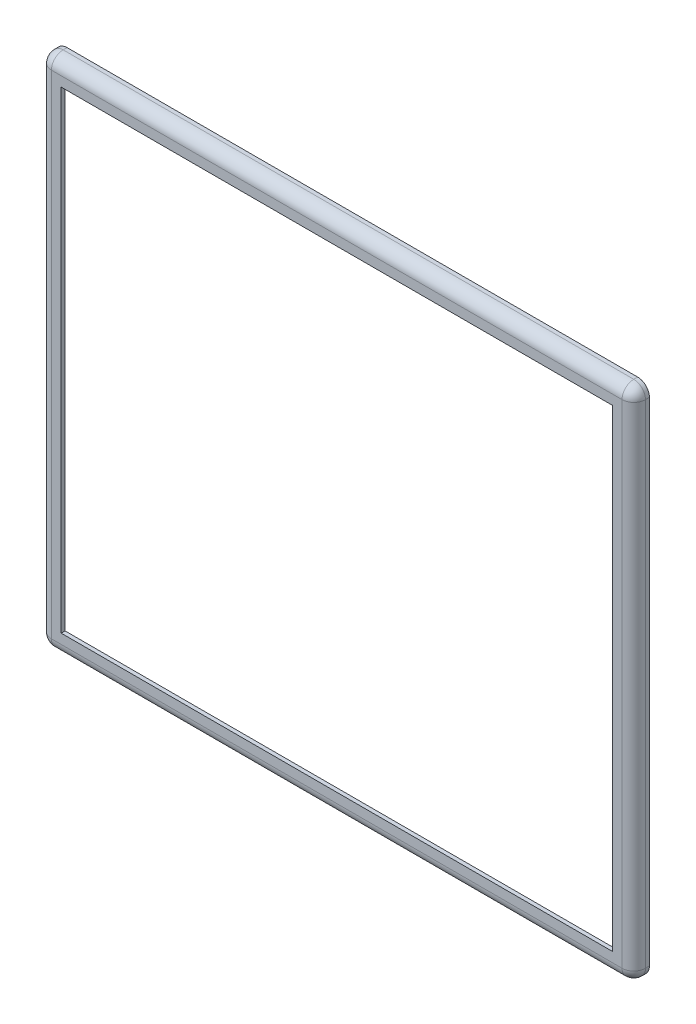
ISO-10303-21;
HEADER;
FILE_DESCRIPTION(('STEP AP214'),'2;1');
FILE_NAME('part.step','',(''),(''),'','','');
FILE_SCHEMA(('AUTOMOTIVE_DESIGN { 1 0 10303 214 1 1 1 1 }'));
ENDSEC;
DATA;
#1=APPLICATION_CONTEXT('core data for automotive mechanical design processes');
#2=APPLICATION_PROTOCOL_DEFINITION('international standard','automotive_design',2000,#1);
#3=PRODUCT_CONTEXT('',#1,'mechanical');
#4=PRODUCT('Part','Part','',(#3));
#5=PRODUCT_RELATED_PRODUCT_CATEGORY('part','',(#4));
#6=PRODUCT_DEFINITION_FORMATION('','',#4);
#7=PRODUCT_DEFINITION_CONTEXT('part definition',#1,'design');
#8=PRODUCT_DEFINITION('design','',#6,#7);
#9=PRODUCT_DEFINITION_SHAPE('','',#8);
#10=(LENGTH_UNIT() NAMED_UNIT(*) SI_UNIT(.MILLI.,.METRE.));
#11=(NAMED_UNIT(*) PLANE_ANGLE_UNIT() SI_UNIT($,.RADIAN.));
#12=(NAMED_UNIT(*) SI_UNIT($,.STERADIAN.) SOLID_ANGLE_UNIT());
#13=UNCERTAINTY_MEASURE_WITH_UNIT(LENGTH_MEASURE(1.E-05),#10,'distance_accuracy_value','');
#14=(GEOMETRIC_REPRESENTATION_CONTEXT(3) GLOBAL_UNCERTAINTY_ASSIGNED_CONTEXT((#13)) GLOBAL_UNIT_ASSIGNED_CONTEXT((#10,
#11,#12)) REPRESENTATION_CONTEXT('',''));
#15=CARTESIAN_POINT('',(0.,0.,0.));
#16=DIRECTION('',(0.,0.,1.));
#17=DIRECTION('',(1.,0.,0.));
#18=AXIS2_PLACEMENT_3D('',#15,#16,#17);
#19=CARTESIAN_POINT('',(0.,0.,0.));
#20=DIRECTION('',(0.,0.,1.));
#21=DIRECTION('',(1.,0.,0.));
#22=AXIS2_PLACEMENT_3D('',#19,#20,#21);
#23=PLANE('',#22);
#24=DIRECTION('',(0.,1.,0.));
#25=VECTOR('',#24,1.);
#26=CARTESIAN_POINT('',(75.6206322795341,58.0332778702163,0.));
#27=LINE('',#26,#25);
#28=CARTESIAN_POINT('',(75.6206322795341,-70.9667221297837,0.));
#29=VERTEX_POINT('',#28);
#30=CARTESIAN_POINT('',(75.6206322795341,55.0332778702163,0.));
#31=VERTEX_POINT('',#30);
#32=EDGE_CURVE('E260',#29,#31,#27,.T.);
#33=ORIENTED_EDGE('',*,*,#32,.F.);
#34=CARTESIAN_POINT('',(72.6206322795341,-70.9667221297837,0.));
#35=DIRECTION('',(0.,0.,1.));
#36=DIRECTION('',(1.,0.,0.));
#37=AXIS2_PLACEMENT_3D('',#34,#35,#36);
#38=CIRCLE('',#37,3.);
#39=CARTESIAN_POINT('',(72.6206322795341,-73.9667221297837,0.));
#40=VERTEX_POINT('',#39);
#41=EDGE_CURVE('E355',#29,#40,#38,.F.);
#42=ORIENTED_EDGE('',*,*,#41,.T.);
#43=DIRECTION('',(1.,0.,0.));
#44=VECTOR('',#43,1.);
#45=CARTESIAN_POINT('',(-76.3793677204659,-73.9667221297837,0.));
#46=LINE('',#45,#44);
#47=CARTESIAN_POINT('',(-73.3793677204659,-73.9667221297837,0.));
#48=VERTEX_POINT('',#47);
#49=EDGE_CURVE('E257',#48,#40,#46,.T.);
#50=ORIENTED_EDGE('',*,*,#49,.F.);
#51=CARTESIAN_POINT('',(-73.3793677204659,-70.9667221297837,0.));
#52=DIRECTION('',(0.,0.,1.));
#53=DIRECTION('',(1.,0.,0.));
#54=AXIS2_PLACEMENT_3D('',#51,#52,#53);
#55=CIRCLE('',#54,3.);
#56=CARTESIAN_POINT('',(-76.3793677204659,-70.9667221297837,0.));
#57=VERTEX_POINT('',#56);
#58=EDGE_CURVE('E349',#48,#57,#55,.F.);
#59=ORIENTED_EDGE('',*,*,#58,.T.);
#60=DIRECTION('',(0.,-1.,0.));
#61=VECTOR('',#60,1.);
#62=CARTESIAN_POINT('',(-76.3793677204659,58.0332778702163,0.));
#63=LINE('',#62,#61);
#64=CARTESIAN_POINT('',(-76.3793677204659,55.0332778702163,0.));
#65=VERTEX_POINT('',#64);
#66=EDGE_CURVE('E254',#65,#57,#63,.T.);
#67=ORIENTED_EDGE('',*,*,#66,.F.);
#68=CARTESIAN_POINT('',(-73.3793677204659,55.0332778702163,0.));
#69=DIRECTION('',(0.,0.,1.));
#70=DIRECTION('',(1.,0.,0.));
#71=AXIS2_PLACEMENT_3D('',#68,#69,#70);
#72=CIRCLE('',#71,3.);
#73=CARTESIAN_POINT('',(-73.3793677204659,58.0332778702163,0.));
#74=VERTEX_POINT('',#73);
#75=EDGE_CURVE('E351',#65,#74,#72,.F.);
#76=ORIENTED_EDGE('',*,*,#75,.T.);
#77=DIRECTION('',(-1.,0.,0.));
#78=VECTOR('',#77,1.);
#79=CARTESIAN_POINT('',(-76.3793677204659,58.0332778702163,0.));
#80=LINE('',#79,#78);
#81=CARTESIAN_POINT('',(72.6206322795341,58.0332778702163,0.));
#82=VERTEX_POINT('',#81);
#83=EDGE_CURVE('E263',#82,#74,#80,.T.);
#84=ORIENTED_EDGE('',*,*,#83,.F.);
#85=CARTESIAN_POINT('',(72.6206322795341,55.0332778702163,0.));
#86=DIRECTION('',(0.,0.,1.));
#87=DIRECTION('',(1.,0.,0.));
#88=AXIS2_PLACEMENT_3D('',#85,#86,#87);
#89=CIRCLE('',#88,3.);
#90=EDGE_CURVE('E353',#82,#31,#89,.F.);
#91=ORIENTED_EDGE('',*,*,#90,.T.);
#92=EDGE_LOOP('',(#33,#42,#50,#59,#67,#76,#84,#91));
#93=FACE_BOUND('',#92,.T.);
#94=DIRECTION('',(-1.,0.,0.));
#95=VECTOR('',#94,1.);
#96=CARTESIAN_POINT('',(-75.3793677204659,57.0332778702163,0.));
#97=LINE('',#96,#95);
#98=CARTESIAN_POINT('',(73.2206322795341,57.0332778702163,0.));
#99=VERTEX_POINT('',#98);
#100=CARTESIAN_POINT('',(-73.9793677204659,57.0332778702163,0.));
#101=VERTEX_POINT('',#100);
#102=EDGE_CURVE('E251',#99,#101,#97,.T.);
#103=ORIENTED_EDGE('',*,*,#102,.T.);
#104=CARTESIAN_POINT('',(-73.9793677204659,55.6332778702163,0.));
#105=DIRECTION('',(0.,0.,1.));
#106=DIRECTION('',(1.,0.,0.));
#107=AXIS2_PLACEMENT_3D('',#104,#105,#106);
#108=CIRCLE('',#107,1.4);
#109=CARTESIAN_POINT('',(-75.3793677204659,55.6332778702163,0.));
#110=VERTEX_POINT('',#109);
#111=EDGE_CURVE('E302',#101,#110,#108,.T.);
#112=ORIENTED_EDGE('',*,*,#111,.T.);
#113=DIRECTION('',(0.,-1.,0.));
#114=VECTOR('',#113,1.);
#115=CARTESIAN_POINT('',(-75.3793677204659,57.0332778702163,0.));
#116=LINE('',#115,#114);
#117=CARTESIAN_POINT('',(-75.3793677204659,-71.5667221297837,0.));
#118=VERTEX_POINT('',#117);
#119=EDGE_CURVE('E218',#110,#118,#116,.T.);
#120=ORIENTED_EDGE('',*,*,#119,.T.);
#121=CARTESIAN_POINT('',(-73.9793677204659,-71.5667221297837,0.));
#122=DIRECTION('',(0.,0.,1.));
#123=DIRECTION('',(1.,0.,0.));
#124=AXIS2_PLACEMENT_3D('',#121,#122,#123);
#125=CIRCLE('',#124,1.4);
#126=CARTESIAN_POINT('',(-73.9793677204659,-72.9667221297837,0.));
#127=VERTEX_POINT('',#126);
#128=EDGE_CURVE('E304',#118,#127,#125,.T.);
#129=ORIENTED_EDGE('',*,*,#128,.T.);
#130=DIRECTION('',(1.,0.,0.));
#131=VECTOR('',#130,1.);
#132=CARTESIAN_POINT('',(-75.3793677204659,-72.9667221297837,0.));
#133=LINE('',#132,#131);
#134=CARTESIAN_POINT('',(73.2206322795341,-72.9667221297837,0.));
#135=VERTEX_POINT('',#134);
#136=EDGE_CURVE('E245',#127,#135,#133,.T.);
#137=ORIENTED_EDGE('',*,*,#136,.T.);
#138=CARTESIAN_POINT('',(73.2206322795341,-71.5667221297837,0.));
#139=DIRECTION('',(0.,0.,1.));
#140=DIRECTION('',(1.,0.,0.));
#141=AXIS2_PLACEMENT_3D('',#138,#139,#140);
#142=CIRCLE('',#141,1.4);
#143=CARTESIAN_POINT('',(74.6206322795341,-71.5667221297837,0.));
#144=VERTEX_POINT('',#143);
#145=EDGE_CURVE('E306',#135,#144,#142,.T.);
#146=ORIENTED_EDGE('',*,*,#145,.T.);
#147=DIRECTION('',(0.,1.,0.));
#148=VECTOR('',#147,1.);
#149=CARTESIAN_POINT('',(74.6206322795341,57.0332778702163,0.));
#150=LINE('',#149,#148);
#151=CARTESIAN_POINT('',(74.6206322795341,55.6332778702163,0.));
#152=VERTEX_POINT('',#151);
#153=EDGE_CURVE('E248',#144,#152,#150,.T.);
#154=ORIENTED_EDGE('',*,*,#153,.T.);
#155=CARTESIAN_POINT('',(73.2206322795341,55.6332778702163,0.));
#156=DIRECTION('',(0.,0.,1.));
#157=DIRECTION('',(1.,0.,0.));
#158=AXIS2_PLACEMENT_3D('',#155,#156,#157);
#159=CIRCLE('',#158,1.4);
#160=EDGE_CURVE('E300',#152,#99,#159,.T.);
#161=ORIENTED_EDGE('',*,*,#160,.T.);
#162=EDGE_LOOP('',(#103,#112,#120,#129,#137,#146,#154,#161));
#163=FACE_BOUND('',#162,.T.);
#164=ADVANCED_FACE('F35',(#93,#163),#23,.F.);
#165=CARTESIAN_POINT('',(-76.3793677204659,58.0332778702163,3.));
#166=DIRECTION('',(1.,0.,0.));
#167=DIRECTION('',(0.,1.,0.));
#168=AXIS2_PLACEMENT_3D('',#165,#166,#167);
#169=PLANE('',#168);
#170=DIRECTION('',(0.,-1.,0.));
#171=VECTOR('',#170,1.);
#172=CARTESIAN_POINT('',(-76.3793677204659,58.0332778702163,1.));
#173=LINE('',#172,#171);
#174=CARTESIAN_POINT('',(-76.3793677204659,-70.9667221297837,1.));
#175=VERTEX_POINT('',#174);
#176=CARTESIAN_POINT('',(-76.3793677204659,55.0332778702163,1.));
#177=VERTEX_POINT('',#176);
#178=EDGE_CURVE('E369',#175,#177,#173,.F.);
#179=ORIENTED_EDGE('',*,*,#178,.T.);
#180=DIRECTION('',(0.,0.,-1.));
#181=VECTOR('',#180,1.);
#182=CARTESIAN_POINT('',(-76.3793677204659,55.0332778702163,3.));
#183=LINE('',#182,#181);
#184=EDGE_CURVE('E373',#177,#65,#183,.T.);
#185=ORIENTED_EDGE('',*,*,#184,.T.);
#186=ORIENTED_EDGE('',*,*,#66,.T.);
#187=DIRECTION('',(0.,0.,-1.));
#188=VECTOR('',#187,1.);
#189=CARTESIAN_POINT('',(-76.3793677204659,-70.9667221297837,3.));
#190=LINE('',#189,#188);
#191=EDGE_CURVE('E371',#57,#175,#190,.F.);
#192=ORIENTED_EDGE('',*,*,#191,.T.);
#193=EDGE_LOOP('',(#179,#185,#186,#192));
#194=FACE_BOUND('',#193,.T.);
#195=ADVANCED_FACE('F423',(#194),#169,.F.);
#196=CARTESIAN_POINT('',(-76.3793677204659,-73.9667221297837,3.));
#197=DIRECTION('',(0.,1.,0.));
#198=DIRECTION('',(0.,0.,1.));
#199=AXIS2_PLACEMENT_3D('',#196,#197,#198);
#200=PLANE('',#199);
#201=ORIENTED_EDGE('',*,*,#49,.T.);
#202=DIRECTION('',(0.,0.,-1.));
#203=VECTOR('',#202,1.);
#204=CARTESIAN_POINT('',(72.6206322795341,-73.9667221297837,3.));
#205=LINE('',#204,#203);
#206=CARTESIAN_POINT('',(72.6206322795341,-73.9667221297837,1.));
#207=VERTEX_POINT('',#206);
#208=EDGE_CURVE('E361',#40,#207,#205,.F.);
#209=ORIENTED_EDGE('',*,*,#208,.T.);
#210=DIRECTION('',(1.,0.,0.));
#211=VECTOR('',#210,1.);
#212=CARTESIAN_POINT('',(-76.3793677204659,-73.9667221297837,1.));
#213=LINE('',#212,#211);
#214=CARTESIAN_POINT('',(-73.3793677204659,-73.9667221297837,1.));
#215=VERTEX_POINT('',#214);
#216=EDGE_CURVE('E357',#207,#215,#213,.F.);
#217=ORIENTED_EDGE('',*,*,#216,.T.);
#218=DIRECTION('',(0.,0.,-1.));
#219=VECTOR('',#218,1.);
#220=CARTESIAN_POINT('',(-73.3793677204659,-73.9667221297837,3.));
#221=LINE('',#220,#219);
#222=EDGE_CURVE('E359',#215,#48,#221,.T.);
#223=ORIENTED_EDGE('',*,*,#222,.T.);
#224=EDGE_LOOP('',(#201,#209,#217,#223));
#225=FACE_BOUND('',#224,.T.);
#226=ADVANCED_FACE('F479',(#225),#200,.F.);
#227=CARTESIAN_POINT('',(75.6206322795341,58.0332778702163,3.));
#228=DIRECTION('',(-1.,0.,0.));
#229=DIRECTION('',(0.,-1.,0.));
#230=AXIS2_PLACEMENT_3D('',#227,#228,#229);
#231=PLANE('',#230);
#232=DIRECTION('',(0.,1.,0.));
#233=VECTOR('',#232,1.);
#234=CARTESIAN_POINT('',(75.6206322795341,-73.9667221297837,1.));
#235=LINE('',#234,#233);
#236=CARTESIAN_POINT('',(75.6206322795341,55.0332778702163,1.));
#237=VERTEX_POINT('',#236);
#238=CARTESIAN_POINT('',(75.6206322795341,-70.9667221297837,1.));
#239=VERTEX_POINT('',#238);
#240=EDGE_CURVE('E308',#237,#239,#235,.F.);
#241=ORIENTED_EDGE('',*,*,#240,.T.);
#242=DIRECTION('',(0.,0.,-1.));
#243=VECTOR('',#242,1.);
#244=CARTESIAN_POINT('',(75.6206322795341,-70.9667221297837,3.));
#245=LINE('',#244,#243);
#246=EDGE_CURVE('E346',#239,#29,#245,.T.);
#247=ORIENTED_EDGE('',*,*,#246,.T.);
#248=ORIENTED_EDGE('',*,*,#32,.T.);
#249=DIRECTION('',(0.,0.,-1.));
#250=VECTOR('',#249,1.);
#251=CARTESIAN_POINT('',(75.6206322795341,55.0332778702163,3.));
#252=LINE('',#251,#250);
#253=EDGE_CURVE('E344',#31,#237,#252,.F.);
#254=ORIENTED_EDGE('',*,*,#253,.T.);
#255=EDGE_LOOP('',(#241,#247,#248,#254));
#256=FACE_BOUND('',#255,.T.);
#257=ADVANCED_FACE('F455',(#256),#231,.F.);
#258=CARTESIAN_POINT('',(-76.3793677204659,58.0332778702163,3.));
#259=DIRECTION('',(0.,-1.,0.));
#260=DIRECTION('',(0.,0.,-1.));
#261=AXIS2_PLACEMENT_3D('',#258,#259,#260);
#262=PLANE('',#261);
#263=DIRECTION('',(-1.,0.,0.));
#264=VECTOR('',#263,1.);
#265=CARTESIAN_POINT('',(75.6206322795341,58.0332778702163,1.));
#266=LINE('',#265,#264);
#267=CARTESIAN_POINT('',(-73.3793677204659,58.0332778702163,1.));
#268=VERTEX_POINT('',#267);
#269=CARTESIAN_POINT('',(72.6206322795341,58.0332778702163,1.));
#270=VERTEX_POINT('',#269);
#271=EDGE_CURVE('E363',#268,#270,#266,.F.);
#272=ORIENTED_EDGE('',*,*,#271,.T.);
#273=DIRECTION('',(0.,0.,-1.));
#274=VECTOR('',#273,1.);
#275=CARTESIAN_POINT('',(72.6206322795341,58.0332778702163,3.));
#276=LINE('',#275,#274);
#277=EDGE_CURVE('E367',#270,#82,#276,.T.);
#278=ORIENTED_EDGE('',*,*,#277,.T.);
#279=ORIENTED_EDGE('',*,*,#83,.T.);
#280=DIRECTION('',(0.,0.,-1.));
#281=VECTOR('',#280,1.);
#282=CARTESIAN_POINT('',(-73.3793677204659,58.0332778702163,3.));
#283=LINE('',#282,#281);
#284=EDGE_CURVE('E365',#74,#268,#283,.F.);
#285=ORIENTED_EDGE('',*,*,#284,.T.);
#286=EDGE_LOOP('',(#272,#278,#279,#285));
#287=FACE_BOUND('',#286,.T.);
#288=ADVANCED_FACE('F468',(#287),#262,.F.);
#289=CARTESIAN_POINT('',(-75.3793677204659,57.0332778702163,3.));
#290=DIRECTION('',(1.,0.,0.));
#291=DIRECTION('',(0.,1.,0.));
#292=AXIS2_PLACEMENT_3D('',#289,#290,#291);
#293=PLANE('',#292);
#294=ORIENTED_EDGE('',*,*,#119,.F.);
#295=DIRECTION('',(0.,0.,-1.));
#296=VECTOR('',#295,1.);
#297=CARTESIAN_POINT('',(-75.3793677204659,55.6332778702163,3.));
#298=LINE('',#297,#296);
#299=CARTESIAN_POINT('',(-75.3793677204659,55.6332778702163,1.6));
#300=VERTEX_POINT('',#299);
#301=EDGE_CURVE('E283',#110,#300,#298,.F.);
#302=ORIENTED_EDGE('',*,*,#301,.T.);
#303=DIRECTION('',(0.,-1.,0.));
#304=VECTOR('',#303,1.);
#305=CARTESIAN_POINT('',(-75.3793677204659,57.0332778702163,1.6));
#306=LINE('',#305,#304);
#307=CARTESIAN_POINT('',(-75.3793677204659,-71.5667221297837,1.6));
#308=VERTEX_POINT('',#307);
#309=EDGE_CURVE('E279',#300,#308,#306,.T.);
#310=ORIENTED_EDGE('',*,*,#309,.T.);
#311=DIRECTION('',(0.,0.,-1.));
#312=VECTOR('',#311,1.);
#313=CARTESIAN_POINT('',(-75.3793677204659,-71.5667221297837,0.));
#314=LINE('',#313,#312);
#315=EDGE_CURVE('E281',#308,#118,#314,.T.);
#316=ORIENTED_EDGE('',*,*,#315,.T.);
#317=EDGE_LOOP('',(#294,#302,#310,#316));
#318=FACE_BOUND('',#317,.T.);
#319=ADVANCED_FACE('F470',(#318),#293,.T.);
#320=CARTESIAN_POINT('',(-75.3793677204659,-72.9667221297837,3.));
#321=DIRECTION('',(0.,1.,0.));
#322=DIRECTION('',(0.,0.,1.));
#323=AXIS2_PLACEMENT_3D('',#320,#321,#322);
#324=PLANE('',#323);
#325=ORIENTED_EDGE('',*,*,#136,.F.);
#326=DIRECTION('',(0.,0.,-1.));
#327=VECTOR('',#326,1.);
#328=CARTESIAN_POINT('',(-73.9793677204659,-72.9667221297837,3.));
#329=LINE('',#328,#327);
#330=CARTESIAN_POINT('',(-73.9793677204659,-72.9667221297837,1.6));
#331=VERTEX_POINT('',#330);
#332=EDGE_CURVE('E289',#127,#331,#329,.F.);
#333=ORIENTED_EDGE('',*,*,#332,.T.);
#334=DIRECTION('',(1.,0.,0.));
#335=VECTOR('',#334,1.);
#336=CARTESIAN_POINT('',(-75.3793677204659,-72.9667221297837,1.6));
#337=LINE('',#336,#335);
#338=CARTESIAN_POINT('',(73.2206322795341,-72.9667221297837,1.6));
#339=VERTEX_POINT('',#338);
#340=EDGE_CURVE('E285',#331,#339,#337,.T.);
#341=ORIENTED_EDGE('',*,*,#340,.T.);
#342=DIRECTION('',(0.,0.,-1.));
#343=VECTOR('',#342,1.);
#344=CARTESIAN_POINT('',(73.2206322795341,-72.9667221297837,0.));
#345=LINE('',#344,#343);
#346=EDGE_CURVE('E287',#339,#135,#345,.T.);
#347=ORIENTED_EDGE('',*,*,#346,.T.);
#348=EDGE_LOOP('',(#325,#333,#341,#347));
#349=FACE_BOUND('',#348,.T.);
#350=ADVANCED_FACE('F476',(#349),#324,.T.);
#351=CARTESIAN_POINT('',(74.6206322795341,57.0332778702163,3.));
#352=DIRECTION('',(-1.,0.,0.));
#353=DIRECTION('',(0.,0.,1.));
#354=AXIS2_PLACEMENT_3D('',#351,#352,#353);
#355=PLANE('',#354);
#356=DIRECTION('',(0.,1.,0.));
#357=VECTOR('',#356,1.);
#358=CARTESIAN_POINT('',(74.6206322795341,57.0332778702163,1.6));
#359=LINE('',#358,#357);
#360=CARTESIAN_POINT('',(74.6206322795341,-71.5667221297837,1.6));
#361=VERTEX_POINT('',#360);
#362=CARTESIAN_POINT('',(74.6206322795341,55.6332778702163,1.6));
#363=VERTEX_POINT('',#362);
#364=EDGE_CURVE('E266',#361,#363,#359,.T.);
#365=ORIENTED_EDGE('',*,*,#364,.T.);
#366=DIRECTION('',(0.,0.,-1.));
#367=VECTOR('',#366,1.);
#368=CARTESIAN_POINT('',(74.6206322795341,55.6332778702163,0.));
#369=LINE('',#368,#367);
#370=EDGE_CURVE('E270',#363,#152,#369,.T.);
#371=ORIENTED_EDGE('',*,*,#370,.T.);
#372=ORIENTED_EDGE('',*,*,#153,.F.);
#373=DIRECTION('',(0.,0.,-1.));
#374=VECTOR('',#373,1.);
#375=CARTESIAN_POINT('',(74.6206322795341,-71.5667221297837,3.));
#376=LINE('',#375,#374);
#377=EDGE_CURVE('E268',#144,#361,#376,.F.);
#378=ORIENTED_EDGE('',*,*,#377,.T.);
#379=EDGE_LOOP('',(#365,#371,#372,#378));
#380=FACE_BOUND('',#379,.T.);
#381=ADVANCED_FACE('F490',(#380),#355,.T.);
#382=CARTESIAN_POINT('',(-75.3793677204659,57.0332778702163,3.));
#383=DIRECTION('',(0.,-1.,0.));
#384=DIRECTION('',(0.,0.,-1.));
#385=AXIS2_PLACEMENT_3D('',#382,#383,#384);
#386=PLANE('',#385);
#387=ORIENTED_EDGE('',*,*,#102,.F.);
#388=DIRECTION('',(0.,0.,-1.));
#389=VECTOR('',#388,1.);
#390=CARTESIAN_POINT('',(73.2206322795341,57.0332778702163,3.));
#391=LINE('',#390,#389);
#392=CARTESIAN_POINT('',(73.2206322795341,57.0332778702163,1.6));
#393=VERTEX_POINT('',#392);
#394=EDGE_CURVE('E277',#99,#393,#391,.F.);
#395=ORIENTED_EDGE('',*,*,#394,.T.);
#396=DIRECTION('',(-1.,0.,0.));
#397=VECTOR('',#396,1.);
#398=CARTESIAN_POINT('',(-75.3793677204659,57.0332778702163,1.6));
#399=LINE('',#398,#397);
#400=CARTESIAN_POINT('',(-73.9793677204659,57.0332778702163,1.6));
#401=VERTEX_POINT('',#400);
#402=EDGE_CURVE('E273',#393,#401,#399,.T.);
#403=ORIENTED_EDGE('',*,*,#402,.T.);
#404=DIRECTION('',(0.,0.,-1.));
#405=VECTOR('',#404,1.);
#406=CARTESIAN_POINT('',(-73.9793677204659,57.0332778702163,0.));
#407=LINE('',#406,#405);
#408=EDGE_CURVE('E275',#401,#101,#407,.T.);
#409=ORIENTED_EDGE('',*,*,#408,.T.);
#410=EDGE_LOOP('',(#387,#395,#403,#409));
#411=FACE_BOUND('',#410,.T.);
#412=ADVANCED_FACE('F494',(#411),#386,.T.);
#413=CARTESIAN_POINT('',(0.,0.,4.));
#414=DIRECTION('',(0.,0.,1.));
#415=DIRECTION('',(1.,0.,0.));
#416=AXIS2_PLACEMENT_3D('',#413,#414,#415);
#417=PLANE('',#416);
#418=DIRECTION('',(1.,0.,0.));
#419=VECTOR('',#418,1.);
#420=CARTESIAN_POINT('',(75.6206322795341,-70.9667221297837,4.));
#421=LINE('',#420,#419);
#422=CARTESIAN_POINT('',(-73.3793677204659,-70.9667221297837,4.));
#423=VERTEX_POINT('',#422);
#424=CARTESIAN_POINT('',(72.6206322795341,-70.9667221297837,4.));
#425=VERTEX_POINT('',#424);
#426=EDGE_CURVE('E375',#423,#425,#421,.T.);
#427=ORIENTED_EDGE('',*,*,#426,.T.);
#428=DIRECTION('',(0.,1.,0.));
#429=VECTOR('',#428,1.);
#430=CARTESIAN_POINT('',(72.6206322795341,58.0332778702163,4.));
#431=LINE('',#430,#429);
#432=CARTESIAN_POINT('',(72.6206322795341,55.0332778702163,4.));
#433=VERTEX_POINT('',#432);
#434=EDGE_CURVE('E11',#425,#433,#431,.T.);
#435=ORIENTED_EDGE('',*,*,#434,.T.);
#436=DIRECTION('',(-1.,0.,0.));
#437=VECTOR('',#436,1.);
#438=CARTESIAN_POINT('',(-76.3793677204659,55.0332778702163,4.));
#439=LINE('',#438,#437);
#440=CARTESIAN_POINT('',(-73.3793677204659,55.0332778702163,4.));
#441=VERTEX_POINT('',#440);
#442=EDGE_CURVE('E44',#433,#441,#439,.T.);
#443=ORIENTED_EDGE('',*,*,#442,.T.);
#444=DIRECTION('',(0.,-1.,0.));
#445=VECTOR('',#444,1.);
#446=CARTESIAN_POINT('',(-73.3793677204659,-73.9667221297837,4.));
#447=LINE('',#446,#445);
#448=EDGE_CURVE('E377',#441,#423,#447,.T.);
#449=ORIENTED_EDGE('',*,*,#448,.T.);
#450=EDGE_LOOP('',(#427,#435,#443,#449));
#451=FACE_BOUND('',#450,.T.);
#452=DIRECTION('',(1.,0.,0.));
#453=VECTOR('',#452,1.);
#454=CARTESIAN_POINT('',(-70.8793677204659,-68.4667221297837,4.));
#455=LINE('',#454,#453);
#456=CARTESIAN_POINT('',(-70.8793677204659,-68.4667221297837,4.));
#457=VERTEX_POINT('',#456);
#458=CARTESIAN_POINT('',(70.1206322795341,-68.4667221297837,4.));
#459=VERTEX_POINT('',#458);
#460=EDGE_CURVE('E210',#457,#459,#455,.T.);
#461=ORIENTED_EDGE('',*,*,#460,.F.);
#462=DIRECTION('',(0.,-1.,0.));
#463=VECTOR('',#462,1.);
#464=CARTESIAN_POINT('',(-70.8793677204659,52.5332778702163,4.));
#465=LINE('',#464,#463);
#466=CARTESIAN_POINT('',(-70.8793677204659,52.5332778702163,4.));
#467=VERTEX_POINT('',#466);
#468=EDGE_CURVE('E200',#467,#457,#465,.T.);
#469=ORIENTED_EDGE('',*,*,#468,.F.);
#470=DIRECTION('',(-1.,0.,0.));
#471=VECTOR('',#470,1.);
#472=CARTESIAN_POINT('',(-70.8793677204659,52.5332778702163,4.));
#473=LINE('',#472,#471);
#474=CARTESIAN_POINT('',(70.1206322795341,52.5332778702163,4.));
#475=VERTEX_POINT('',#474);
#476=EDGE_CURVE('E226',#475,#467,#473,.T.);
#477=ORIENTED_EDGE('',*,*,#476,.F.);
#478=DIRECTION('',(0.,1.,0.));
#479=VECTOR('',#478,1.);
#480=CARTESIAN_POINT('',(70.1206322795341,52.5332778702163,4.));
#481=LINE('',#480,#479);
#482=EDGE_CURVE('E224',#459,#475,#481,.T.);
#483=ORIENTED_EDGE('',*,*,#482,.F.);
#484=EDGE_LOOP('',(#461,#469,#477,#483));
#485=FACE_BOUND('',#484,.T.);
#486=ADVANCED_FACE('F222',(#451,#485),#417,.T.);
#487=CARTESIAN_POINT('',(0.,0.,3.));
#488=DIRECTION('',(0.,0.,1.));
#489=DIRECTION('',(1.,0.,0.));
#490=AXIS2_PLACEMENT_3D('',#487,#488,#489);
#491=PLANE('',#490);
#492=DIRECTION('',(-1.,0.,0.));
#493=VECTOR('',#492,1.);
#494=CARTESIAN_POINT('',(0.,55.6332778702163,3.));
#495=LINE('',#494,#493);
#496=CARTESIAN_POINT('',(-73.9793677204659,55.6332778702163,3.));
#497=VERTEX_POINT('',#496);
#498=CARTESIAN_POINT('',(73.2206322795341,55.6332778702163,3.));
#499=VERTEX_POINT('',#498);
#500=EDGE_CURVE('E295',#497,#499,#495,.F.);
#501=ORIENTED_EDGE('',*,*,#500,.T.);
#502=DIRECTION('',(0.,1.,0.));
#503=VECTOR('',#502,1.);
#504=CARTESIAN_POINT('',(73.2206322795341,0.,3.));
#505=LINE('',#504,#503);
#506=CARTESIAN_POINT('',(73.2206322795341,-71.5667221297837,3.));
#507=VERTEX_POINT('',#506);
#508=EDGE_CURVE('E297',#499,#507,#505,.F.);
#509=ORIENTED_EDGE('',*,*,#508,.T.);
#510=DIRECTION('',(1.,0.,0.));
#511=VECTOR('',#510,1.);
#512=CARTESIAN_POINT('',(0.,-71.5667221297837,3.));
#513=LINE('',#512,#511);
#514=CARTESIAN_POINT('',(-73.9793677204659,-71.5667221297837,3.));
#515=VERTEX_POINT('',#514);
#516=EDGE_CURVE('E291',#507,#515,#513,.F.);
#517=ORIENTED_EDGE('',*,*,#516,.T.);
#518=DIRECTION('',(0.,-1.,0.));
#519=VECTOR('',#518,1.);
#520=CARTESIAN_POINT('',(-73.9793677204659,0.,3.));
#521=LINE('',#520,#519);
#522=EDGE_CURVE('E293',#515,#497,#521,.F.);
#523=ORIENTED_EDGE('',*,*,#522,.T.);
#524=EDGE_LOOP('',(#501,#509,#517,#523));
#525=FACE_BOUND('',#524,.T.);
#526=DIRECTION('',(0.,-1.,0.));
#527=VECTOR('',#526,1.);
#528=CARTESIAN_POINT('',(-70.8793677204659,52.5332778702163,3.));
#529=LINE('',#528,#527);
#530=CARTESIAN_POINT('',(-70.8793677204659,52.5332778702163,3.));
#531=VERTEX_POINT('',#530);
#532=CARTESIAN_POINT('',(-70.8793677204659,-68.4667221297837,3.));
#533=VERTEX_POINT('',#532);
#534=EDGE_CURVE('E230',#531,#533,#529,.T.);
#535=ORIENTED_EDGE('',*,*,#534,.T.);
#536=DIRECTION('',(1.,0.,0.));
#537=VECTOR('',#536,1.);
#538=CARTESIAN_POINT('',(-70.8793677204659,-68.4667221297837,3.));
#539=LINE('',#538,#537);
#540=CARTESIAN_POINT('',(70.1206322795341,-68.4667221297837,3.));
#541=VERTEX_POINT('',#540);
#542=EDGE_CURVE('E217',#533,#541,#539,.T.);
#543=ORIENTED_EDGE('',*,*,#542,.T.);
#544=DIRECTION('',(0.,1.,0.));
#545=VECTOR('',#544,1.);
#546=CARTESIAN_POINT('',(70.1206322795341,52.5332778702163,3.));
#547=LINE('',#546,#545);
#548=CARTESIAN_POINT('',(70.1206322795341,52.5332778702163,3.));
#549=VERTEX_POINT('',#548);
#550=EDGE_CURVE('E234',#541,#549,#547,.T.);
#551=ORIENTED_EDGE('',*,*,#550,.T.);
#552=DIRECTION('',(-1.,0.,0.));
#553=VECTOR('',#552,1.);
#554=CARTESIAN_POINT('',(-70.8793677204659,52.5332778702163,3.));
#555=LINE('',#554,#553);
#556=EDGE_CURVE('E211',#549,#531,#555,.T.);
#557=ORIENTED_EDGE('',*,*,#556,.T.);
#558=EDGE_LOOP('',(#535,#543,#551,#557));
#559=FACE_BOUND('',#558,.T.);
#560=ADVANCED_FACE('F499',(#525,#559),#491,.F.);
#561=CARTESIAN_POINT('',(-70.8793677204659,52.5332778702163,4.));
#562=DIRECTION('',(1.,0.,0.));
#563=DIRECTION('',(0.,1.,0.));
#564=AXIS2_PLACEMENT_3D('',#561,#562,#563);
#565=PLANE('',#564);
#566=ORIENTED_EDGE('',*,*,#534,.F.);
#567=DIRECTION('',(0.,0.,-1.));
#568=VECTOR('',#567,1.);
#569=CARTESIAN_POINT('',(-70.8793677204659,52.5332778702163,4.));
#570=LINE('',#569,#568);
#571=EDGE_CURVE('E206',#467,#531,#570,.T.);
#572=ORIENTED_EDGE('',*,*,#571,.F.);
#573=ORIENTED_EDGE('',*,*,#468,.T.);
#574=DIRECTION('',(0.,0.,-1.));
#575=VECTOR('',#574,1.);
#576=CARTESIAN_POINT('',(-70.8793677204659,-68.4667221297837,4.));
#577=LINE('',#576,#575);
#578=EDGE_CURVE('E203',#457,#533,#577,.T.);
#579=ORIENTED_EDGE('',*,*,#578,.T.);
#580=EDGE_LOOP('',(#566,#572,#573,#579));
#581=FACE_BOUND('',#580,.T.);
#582=ADVANCED_FACE('F202',(#581),#565,.T.);
#583=CARTESIAN_POINT('',(-70.8793677204659,-68.4667221297837,4.));
#584=DIRECTION('',(0.,1.,0.));
#585=DIRECTION('',(0.,0.,1.));
#586=AXIS2_PLACEMENT_3D('',#583,#584,#585);
#587=PLANE('',#586);
#588=ORIENTED_EDGE('',*,*,#542,.F.);
#589=ORIENTED_EDGE('',*,*,#578,.F.);
#590=ORIENTED_EDGE('',*,*,#460,.T.);
#591=DIRECTION('',(0.,0.,-1.));
#592=VECTOR('',#591,1.);
#593=CARTESIAN_POINT('',(70.1206322795341,-68.4667221297837,4.));
#594=LINE('',#593,#592);
#595=EDGE_CURVE('E219',#459,#541,#594,.T.);
#596=ORIENTED_EDGE('',*,*,#595,.T.);
#597=EDGE_LOOP('',(#588,#589,#590,#596));
#598=FACE_BOUND('',#597,.T.);
#599=ADVANCED_FACE('F214',(#598),#587,.T.);
#600=CARTESIAN_POINT('',(70.1206322795341,52.5332778702163,4.));
#601=DIRECTION('',(-1.,0.,0.));
#602=DIRECTION('',(0.,-1.,0.));
#603=AXIS2_PLACEMENT_3D('',#600,#601,#602);
#604=PLANE('',#603);
#605=ORIENTED_EDGE('',*,*,#550,.F.);
#606=ORIENTED_EDGE('',*,*,#595,.F.);
#607=ORIENTED_EDGE('',*,*,#482,.T.);
#608=DIRECTION('',(0.,0.,-1.));
#609=VECTOR('',#608,1.);
#610=CARTESIAN_POINT('',(70.1206322795341,52.5332778702163,4.));
#611=LINE('',#610,#609);
#612=EDGE_CURVE('E240',#475,#549,#611,.T.);
#613=ORIENTED_EDGE('',*,*,#612,.T.);
#614=EDGE_LOOP('',(#605,#606,#607,#613));
#615=FACE_BOUND('',#614,.T.);
#616=ADVANCED_FACE('F509',(#615),#604,.T.);
#617=CARTESIAN_POINT('',(-70.8793677204659,52.5332778702163,4.));
#618=DIRECTION('',(0.,-1.,0.));
#619=DIRECTION('',(0.,0.,-1.));
#620=AXIS2_PLACEMENT_3D('',#617,#618,#619);
#621=PLANE('',#620);
#622=ORIENTED_EDGE('',*,*,#556,.F.);
#623=ORIENTED_EDGE('',*,*,#612,.F.);
#624=ORIENTED_EDGE('',*,*,#476,.T.);
#625=ORIENTED_EDGE('',*,*,#571,.T.);
#626=EDGE_LOOP('',(#622,#623,#624,#625));
#627=FACE_BOUND('',#626,.T.);
#628=ADVANCED_FACE('F512',(#627),#621,.T.);
#629=CARTESIAN_POINT('',(-73.9793677204659,-71.5667221297837,3.));
#630=DIRECTION('',(0.,0.,1.));
#631=DIRECTION('',(1.,0.,0.));
#632=AXIS2_PLACEMENT_3D('',#629,#630,#631);
#633=CYLINDRICAL_SURFACE('',#632,1.4);
#634=CARTESIAN_POINT('',(-73.9793677204659,-71.5667221297837,1.6));
#635=DIRECTION('',(0.,0.,-1.));
#636=DIRECTION('',(-1.,0.,0.));
#637=AXIS2_PLACEMENT_3D('',#634,#635,#636);
#638=CIRCLE('',#637,1.4);
#639=EDGE_CURVE('E232',#331,#308,#638,.T.);
#640=ORIENTED_EDGE('',*,*,#639,.F.);
#641=ORIENTED_EDGE('',*,*,#332,.F.);
#642=ORIENTED_EDGE('',*,*,#128,.F.);
#643=ORIENTED_EDGE('',*,*,#315,.F.);
#644=EDGE_LOOP('',(#640,#641,#642,#643));
#645=FACE_BOUND('',#644,.T.);
#646=ADVANCED_FACE('F515',(#645),#633,.F.);
#647=CARTESIAN_POINT('',(-73.9793677204659,-71.5667221297837,1.6));
#648=DIRECTION('',(0.,0.,1.));
#649=DIRECTION('',(1.,0.,0.));
#650=AXIS2_PLACEMENT_3D('',#647,#648,#649);
#651=SPHERICAL_SURFACE('',#650,1.4);
#652=CARTESIAN_POINT('',(-73.9793677204659,-71.5667221297837,1.6));
#653=DIRECTION('',(1.,0.,0.));
#654=DIRECTION('',(0.,0.,-1.));
#655=AXIS2_PLACEMENT_3D('',#652,#653,#654);
#656=CIRCLE('',#655,1.4);
#657=EDGE_CURVE('E335',#331,#515,#656,.F.);
#658=ORIENTED_EDGE('',*,*,#657,.F.);
#659=ORIENTED_EDGE('',*,*,#639,.T.);
#660=CARTESIAN_POINT('',(-73.9793677204659,-71.5667221297837,1.6));
#661=DIRECTION('',(0.,1.,0.));
#662=DIRECTION('',(0.,0.,1.));
#663=AXIS2_PLACEMENT_3D('',#660,#661,#662);
#664=CIRCLE('',#663,1.4);
#665=EDGE_CURVE('E338',#515,#308,#664,.F.);
#666=ORIENTED_EDGE('',*,*,#665,.F.);
#667=EDGE_LOOP('',(#658,#659,#666));
#668=FACE_BOUND('',#667,.T.);
#669=ADVANCED_FACE('F520',(#668),#651,.F.);
#670=CARTESIAN_POINT('',(-73.9793677204659,55.6332778702163,3.));
#671=DIRECTION('',(0.,0.,1.));
#672=DIRECTION('',(1.,0.,0.));
#673=AXIS2_PLACEMENT_3D('',#670,#671,#672);
#674=CYLINDRICAL_SURFACE('',#673,1.4);
#675=ORIENTED_EDGE('',*,*,#111,.F.);
#676=ORIENTED_EDGE('',*,*,#408,.F.);
#677=CARTESIAN_POINT('',(-73.9793677204659,55.6332778702163,1.6));
#678=DIRECTION('',(0.,0.,-1.));
#679=DIRECTION('',(-1.,0.,0.));
#680=AXIS2_PLACEMENT_3D('',#677,#678,#679);
#681=CIRCLE('',#680,1.4);
#682=EDGE_CURVE('E332',#300,#401,#681,.T.);
#683=ORIENTED_EDGE('',*,*,#682,.F.);
#684=ORIENTED_EDGE('',*,*,#301,.F.);
#685=EDGE_LOOP('',(#675,#676,#683,#684));
#686=FACE_BOUND('',#685,.T.);
#687=ADVANCED_FACE('F529',(#686),#674,.F.);
#688=CARTESIAN_POINT('',(-73.9793677204659,57.0332778702163,1.6));
#689=DIRECTION('',(0.,-1.,0.));
#690=DIRECTION('',(1.,0.,0.));
#691=AXIS2_PLACEMENT_3D('',#688,#689,#690);
#692=CYLINDRICAL_SURFACE('',#691,1.4);
#693=ORIENTED_EDGE('',*,*,#665,.T.);
#694=ORIENTED_EDGE('',*,*,#309,.F.);
#695=CARTESIAN_POINT('',(-73.9793677204659,55.6332778702163,1.6));
#696=DIRECTION('',(0.,-1.,0.));
#697=DIRECTION('',(0.,0.,-1.));
#698=AXIS2_PLACEMENT_3D('',#695,#696,#697);
#699=CIRCLE('',#698,1.4);
#700=EDGE_CURVE('E329',#497,#300,#699,.T.);
#701=ORIENTED_EDGE('',*,*,#700,.F.);
#702=ORIENTED_EDGE('',*,*,#522,.F.);
#703=EDGE_LOOP('',(#693,#694,#701,#702));
#704=FACE_BOUND('',#703,.T.);
#705=ADVANCED_FACE('F595',(#704),#692,.F.);
#706=CARTESIAN_POINT('',(-75.3793677204659,-71.5667221297837,1.6));
#707=DIRECTION('',(1.,0.,0.));
#708=DIRECTION('',(0.,0.,-1.));
#709=AXIS2_PLACEMENT_3D('',#706,#707,#708);
#710=CYLINDRICAL_SURFACE('',#709,1.4);
#711=ORIENTED_EDGE('',*,*,#657,.T.);
#712=ORIENTED_EDGE('',*,*,#516,.F.);
#713=CARTESIAN_POINT('',(73.2206322795341,-71.5667221297837,1.6));
#714=DIRECTION('',(-1.,0.,0.));
#715=DIRECTION('',(0.,0.,1.));
#716=AXIS2_PLACEMENT_3D('',#713,#714,#715);
#717=CIRCLE('',#716,1.4);
#718=EDGE_CURVE('E326',#339,#507,#717,.T.);
#719=ORIENTED_EDGE('',*,*,#718,.F.);
#720=ORIENTED_EDGE('',*,*,#340,.F.);
#721=EDGE_LOOP('',(#711,#712,#719,#720));
#722=FACE_BOUND('',#721,.T.);
#723=ADVANCED_FACE('F591',(#722),#710,.F.);
#724=CARTESIAN_POINT('',(73.2206322795341,-71.5667221297837,3.));
#725=DIRECTION('',(0.,0.,1.));
#726=DIRECTION('',(1.,0.,0.));
#727=AXIS2_PLACEMENT_3D('',#724,#725,#726);
#728=CYLINDRICAL_SURFACE('',#727,1.4);
#729=ORIENTED_EDGE('',*,*,#145,.F.);
#730=ORIENTED_EDGE('',*,*,#346,.F.);
#731=CARTESIAN_POINT('',(73.2206322795341,-71.5667221297837,1.6));
#732=DIRECTION('',(0.,0.,-1.));
#733=DIRECTION('',(-1.,0.,0.));
#734=AXIS2_PLACEMENT_3D('',#731,#732,#733);
#735=CIRCLE('',#734,1.4);
#736=EDGE_CURVE('E323',#361,#339,#735,.T.);
#737=ORIENTED_EDGE('',*,*,#736,.F.);
#738=ORIENTED_EDGE('',*,*,#377,.F.);
#739=EDGE_LOOP('',(#729,#730,#737,#738));
#740=FACE_BOUND('',#739,.T.);
#741=ADVANCED_FACE('F587',(#740),#728,.F.);
#742=CARTESIAN_POINT('',(-73.9793677204659,55.6332778702163,1.6));
#743=DIRECTION('',(0.,0.,1.));
#744=DIRECTION('',(1.,0.,0.));
#745=AXIS2_PLACEMENT_3D('',#742,#743,#744);
#746=SPHERICAL_SURFACE('',#745,1.4);
#747=ORIENTED_EDGE('',*,*,#700,.T.);
#748=ORIENTED_EDGE('',*,*,#682,.T.);
#749=CARTESIAN_POINT('',(-73.9793677204659,55.6332778702163,1.6));
#750=DIRECTION('',(1.,0.,0.));
#751=DIRECTION('',(0.,0.,-1.));
#752=AXIS2_PLACEMENT_3D('',#749,#750,#751);
#753=CIRCLE('',#752,1.4);
#754=EDGE_CURVE('E320',#497,#401,#753,.F.);
#755=ORIENTED_EDGE('',*,*,#754,.F.);
#756=EDGE_LOOP('',(#747,#748,#755));
#757=FACE_BOUND('',#756,.T.);
#758=ADVANCED_FACE('F583',(#757),#746,.F.);
#759=CARTESIAN_POINT('',(73.2206322795341,-71.5667221297837,1.6));
#760=DIRECTION('',(0.,0.,1.));
#761=DIRECTION('',(1.,0.,0.));
#762=AXIS2_PLACEMENT_3D('',#759,#760,#761);
#763=SPHERICAL_SURFACE('',#762,1.4);
#764=ORIENTED_EDGE('',*,*,#736,.T.);
#765=ORIENTED_EDGE('',*,*,#718,.T.);
#766=CARTESIAN_POINT('',(73.2206322795341,-71.5667221297837,1.6));
#767=DIRECTION('',(0.,1.,0.));
#768=DIRECTION('',(0.,0.,1.));
#769=AXIS2_PLACEMENT_3D('',#766,#767,#768);
#770=CIRCLE('',#769,1.4);
#771=EDGE_CURVE('E318',#361,#507,#770,.F.);
#772=ORIENTED_EDGE('',*,*,#771,.F.);
#773=EDGE_LOOP('',(#764,#765,#772));
#774=FACE_BOUND('',#773,.T.);
#775=ADVANCED_FACE('F579',(#774),#763,.F.);
#776=CARTESIAN_POINT('',(-75.3793677204659,55.6332778702163,1.6));
#777=DIRECTION('',(-1.,0.,0.));
#778=DIRECTION('',(0.,0.,1.));
#779=AXIS2_PLACEMENT_3D('',#776,#777,#778);
#780=CYLINDRICAL_SURFACE('',#779,1.4);
#781=ORIENTED_EDGE('',*,*,#754,.T.);
#782=ORIENTED_EDGE('',*,*,#402,.F.);
#783=CARTESIAN_POINT('',(73.2206322795341,55.6332778702163,1.6));
#784=DIRECTION('',(-1.,0.,0.));
#785=DIRECTION('',(0.,0.,1.));
#786=AXIS2_PLACEMENT_3D('',#783,#784,#785);
#787=CIRCLE('',#786,1.4);
#788=EDGE_CURVE('E315',#499,#393,#787,.T.);
#789=ORIENTED_EDGE('',*,*,#788,.F.);
#790=ORIENTED_EDGE('',*,*,#500,.F.);
#791=EDGE_LOOP('',(#781,#782,#789,#790));
#792=FACE_BOUND('',#791,.T.);
#793=ADVANCED_FACE('F575',(#792),#780,.F.);
#794=CARTESIAN_POINT('',(73.2206322795341,57.0332778702163,1.6));
#795=DIRECTION('',(0.,1.,0.));
#796=DIRECTION('',(0.,0.,1.));
#797=AXIS2_PLACEMENT_3D('',#794,#795,#796);
#798=CYLINDRICAL_SURFACE('',#797,1.4);
#799=ORIENTED_EDGE('',*,*,#771,.T.);
#800=ORIENTED_EDGE('',*,*,#508,.F.);
#801=CARTESIAN_POINT('',(73.2206322795341,55.6332778702163,1.6));
#802=DIRECTION('',(0.,-1.,0.));
#803=DIRECTION('',(0.,0.,-1.));
#804=AXIS2_PLACEMENT_3D('',#801,#802,#803);
#805=CIRCLE('',#804,1.4);
#806=EDGE_CURVE('E312',#363,#499,#805,.T.);
#807=ORIENTED_EDGE('',*,*,#806,.F.);
#808=ORIENTED_EDGE('',*,*,#364,.F.);
#809=EDGE_LOOP('',(#799,#800,#807,#808));
#810=FACE_BOUND('',#809,.T.);
#811=ADVANCED_FACE('F568',(#810),#798,.F.);
#812=CARTESIAN_POINT('',(73.2206322795341,55.6332778702163,1.6));
#813=DIRECTION('',(0.,0.,1.));
#814=DIRECTION('',(1.,0.,0.));
#815=AXIS2_PLACEMENT_3D('',#812,#813,#814);
#816=SPHERICAL_SURFACE('',#815,1.4);
#817=ORIENTED_EDGE('',*,*,#806,.T.);
#818=ORIENTED_EDGE('',*,*,#788,.T.);
#819=CARTESIAN_POINT('',(73.2206322795341,55.6332778702163,1.6));
#820=DIRECTION('',(0.,0.,-1.));
#821=DIRECTION('',(-1.,0.,0.));
#822=AXIS2_PLACEMENT_3D('',#819,#820,#821);
#823=CIRCLE('',#822,1.4);
#824=EDGE_CURVE('E309',#363,#393,#823,.F.);
#825=ORIENTED_EDGE('',*,*,#824,.F.);
#826=EDGE_LOOP('',(#817,#818,#825));
#827=FACE_BOUND('',#826,.T.);
#828=ADVANCED_FACE('F562',(#827),#816,.F.);
#829=CARTESIAN_POINT('',(73.2206322795341,55.6332778702163,3.));
#830=DIRECTION('',(0.,0.,1.));
#831=DIRECTION('',(1.,0.,0.));
#832=AXIS2_PLACEMENT_3D('',#829,#830,#831);
#833=CYLINDRICAL_SURFACE('',#832,1.4);
#834=ORIENTED_EDGE('',*,*,#824,.T.);
#835=ORIENTED_EDGE('',*,*,#394,.F.);
#836=ORIENTED_EDGE('',*,*,#160,.F.);
#837=ORIENTED_EDGE('',*,*,#370,.F.);
#838=EDGE_LOOP('',(#834,#835,#836,#837));
#839=FACE_BOUND('',#838,.T.);
#840=ADVANCED_FACE('F558',(#839),#833,.F.);
#841=CARTESIAN_POINT('',(-73.3793677204659,55.0332778702163,3.));
#842=DIRECTION('',(0.,0.,-1.));
#843=DIRECTION('',(-1.,0.,0.));
#844=AXIS2_PLACEMENT_3D('',#841,#842,#843);
#845=CYLINDRICAL_SURFACE('',#844,3.);
#846=CARTESIAN_POINT('',(-73.3793677204659,55.0332778702163,1.));
#847=DIRECTION('',(0.,0.,1.));
#848=DIRECTION('',(1.,0.,0.));
#849=AXIS2_PLACEMENT_3D('',#846,#847,#848);
#850=CIRCLE('',#849,3.);
#851=EDGE_CURVE('E39',#268,#177,#850,.T.);
#852=ORIENTED_EDGE('',*,*,#851,.F.);
#853=ORIENTED_EDGE('',*,*,#284,.F.);
#854=ORIENTED_EDGE('',*,*,#75,.F.);
#855=ORIENTED_EDGE('',*,*,#184,.F.);
#856=EDGE_LOOP('',(#852,#853,#854,#855));
#857=FACE_BOUND('',#856,.T.);
#858=ADVANCED_FACE('F37',(#857),#845,.T.);
#859=CARTESIAN_POINT('',(-73.3793677204659,55.0332778702163,1.));
#860=DIRECTION('',(0.,0.,1.));
#861=DIRECTION('',(1.,0.,0.));
#862=AXIS2_PLACEMENT_3D('',#859,#860,#861);
#863=SPHERICAL_SURFACE('',#862,3.);
#864=CARTESIAN_POINT('',(-73.3793677204659,55.0332778702163,1.));
#865=DIRECTION('',(-1.,0.,0.));
#866=DIRECTION('',(0.,0.,1.));
#867=AXIS2_PLACEMENT_3D('',#864,#865,#866);
#868=CIRCLE('',#867,3.);
#869=EDGE_CURVE('E404',#268,#441,#868,.F.);
#870=ORIENTED_EDGE('',*,*,#869,.F.);
#871=ORIENTED_EDGE('',*,*,#851,.T.);
#872=CARTESIAN_POINT('',(-73.3793677204659,55.0332778702163,1.));
#873=DIRECTION('',(0.,1.,0.));
#874=DIRECTION('',(0.,0.,1.));
#875=AXIS2_PLACEMENT_3D('',#872,#873,#874);
#876=CIRCLE('',#875,3.);
#877=EDGE_CURVE('E405',#441,#177,#876,.F.);
#878=ORIENTED_EDGE('',*,*,#877,.F.);
#879=EDGE_LOOP('',(#870,#871,#878));
#880=FACE_BOUND('',#879,.T.);
#881=ADVANCED_FACE('F415',(#880),#863,.T.);
#882=CARTESIAN_POINT('',(-73.3793677204659,-70.9667221297837,3.));
#883=DIRECTION('',(0.,0.,-1.));
#884=DIRECTION('',(-1.,0.,0.));
#885=AXIS2_PLACEMENT_3D('',#882,#883,#884);
#886=CYLINDRICAL_SURFACE('',#885,3.);
#887=ORIENTED_EDGE('',*,*,#58,.F.);
#888=ORIENTED_EDGE('',*,*,#222,.F.);
#889=CARTESIAN_POINT('',(-73.3793677204659,-70.9667221297837,1.));
#890=DIRECTION('',(0.,0.,1.));
#891=DIRECTION('',(1.,0.,0.));
#892=AXIS2_PLACEMENT_3D('',#889,#890,#891);
#893=CIRCLE('',#892,3.);
#894=EDGE_CURVE('E401',#175,#215,#893,.T.);
#895=ORIENTED_EDGE('',*,*,#894,.F.);
#896=ORIENTED_EDGE('',*,*,#191,.F.);
#897=EDGE_LOOP('',(#887,#888,#895,#896));
#898=FACE_BOUND('',#897,.T.);
#899=ADVANCED_FACE('F433',(#898),#886,.T.);
#900=CARTESIAN_POINT('',(-73.3793677204659,0.,1.));
#901=DIRECTION('',(0.,1.,0.));
#902=DIRECTION('',(-1.,0.,0.));
#903=AXIS2_PLACEMENT_3D('',#900,#901,#902);
#904=CYLINDRICAL_SURFACE('',#903,3.);
#905=ORIENTED_EDGE('',*,*,#877,.T.);
#906=ORIENTED_EDGE('',*,*,#178,.F.);
#907=CARTESIAN_POINT('',(-73.3793677204659,-70.9667221297837,1.));
#908=DIRECTION('',(0.,-1.,0.));
#909=DIRECTION('',(0.,0.,-1.));
#910=AXIS2_PLACEMENT_3D('',#907,#908,#909);
#911=CIRCLE('',#910,3.);
#912=EDGE_CURVE('E398',#423,#175,#911,.T.);
#913=ORIENTED_EDGE('',*,*,#912,.F.);
#914=ORIENTED_EDGE('',*,*,#448,.F.);
#915=EDGE_LOOP('',(#905,#906,#913,#914));
#916=FACE_BOUND('',#915,.T.);
#917=ADVANCED_FACE('F436',(#916),#904,.T.);
#918=CARTESIAN_POINT('',(0.,55.0332778702163,1.));
#919=DIRECTION('',(1.,0.,0.));
#920=DIRECTION('',(0.,0.,-1.));
#921=AXIS2_PLACEMENT_3D('',#918,#919,#920);
#922=CYLINDRICAL_SURFACE('',#921,3.);
#923=ORIENTED_EDGE('',*,*,#869,.T.);
#924=ORIENTED_EDGE('',*,*,#442,.F.);
#925=CARTESIAN_POINT('',(72.6206322795341,55.0332778702163,1.));
#926=DIRECTION('',(1.,0.,0.));
#927=DIRECTION('',(0.,0.,-1.));
#928=AXIS2_PLACEMENT_3D('',#925,#926,#927);
#929=CIRCLE('',#928,3.);
#930=EDGE_CURVE('E396',#270,#433,#929,.T.);
#931=ORIENTED_EDGE('',*,*,#930,.F.);
#932=ORIENTED_EDGE('',*,*,#271,.F.);
#933=EDGE_LOOP('',(#923,#924,#931,#932));
#934=FACE_BOUND('',#933,.T.);
#935=ADVANCED_FACE('F466',(#934),#922,.T.);
#936=CARTESIAN_POINT('',(72.6206322795341,55.0332778702163,3.));
#937=DIRECTION('',(0.,0.,-1.));
#938=DIRECTION('',(-1.,0.,0.));
#939=AXIS2_PLACEMENT_3D('',#936,#937,#938);
#940=CYLINDRICAL_SURFACE('',#939,3.);
#941=ORIENTED_EDGE('',*,*,#90,.F.);
#942=ORIENTED_EDGE('',*,*,#277,.F.);
#943=CARTESIAN_POINT('',(72.6206322795341,55.0332778702163,1.));
#944=DIRECTION('',(0.,0.,1.));
#945=DIRECTION('',(1.,0.,0.));
#946=AXIS2_PLACEMENT_3D('',#943,#944,#945);
#947=CIRCLE('',#946,3.);
#948=EDGE_CURVE('E393',#237,#270,#947,.T.);
#949=ORIENTED_EDGE('',*,*,#948,.F.);
#950=ORIENTED_EDGE('',*,*,#253,.F.);
#951=EDGE_LOOP('',(#941,#942,#949,#950));
#952=FACE_BOUND('',#951,.T.);
#953=ADVANCED_FACE('F460',(#952),#940,.T.);
#954=CARTESIAN_POINT('',(-73.3793677204659,-70.9667221297837,1.));
#955=DIRECTION('',(0.,0.,1.));
#956=DIRECTION('',(1.,0.,0.));
#957=AXIS2_PLACEMENT_3D('',#954,#955,#956);
#958=SPHERICAL_SURFACE('',#957,3.);
#959=ORIENTED_EDGE('',*,*,#912,.T.);
#960=ORIENTED_EDGE('',*,*,#894,.T.);
#961=CARTESIAN_POINT('',(-73.3793677204659,-70.9667221297837,1.));
#962=DIRECTION('',(-1.,0.,0.));
#963=DIRECTION('',(0.,0.,1.));
#964=AXIS2_PLACEMENT_3D('',#961,#962,#963);
#965=CIRCLE('',#964,3.);
#966=EDGE_CURVE('E390',#423,#215,#965,.F.);
#967=ORIENTED_EDGE('',*,*,#966,.F.);
#968=EDGE_LOOP('',(#959,#960,#967));
#969=FACE_BOUND('',#968,.T.);
#970=ADVANCED_FACE('F440',(#969),#958,.T.);
#971=CARTESIAN_POINT('',(72.6206322795341,55.0332778702163,1.));
#972=DIRECTION('',(0.,0.,1.));
#973=DIRECTION('',(1.,0.,0.));
#974=AXIS2_PLACEMENT_3D('',#971,#972,#973);
#975=SPHERICAL_SURFACE('',#974,3.);
#976=ORIENTED_EDGE('',*,*,#948,.T.);
#977=ORIENTED_EDGE('',*,*,#930,.T.);
#978=CARTESIAN_POINT('',(72.6206322795341,55.0332778702163,1.));
#979=DIRECTION('',(0.,1.,0.));
#980=DIRECTION('',(0.,0.,1.));
#981=AXIS2_PLACEMENT_3D('',#978,#979,#980);
#982=CIRCLE('',#981,3.);
#983=EDGE_CURVE('E52',#237,#433,#982,.F.);
#984=ORIENTED_EDGE('',*,*,#983,.F.);
#985=EDGE_LOOP('',(#976,#977,#984));
#986=FACE_BOUND('',#985,.T.);
#987=ADVANCED_FACE('F464',(#986),#975,.T.);
#988=CARTESIAN_POINT('',(0.,-70.9667221297837,1.));
#989=DIRECTION('',(-1.,0.,0.));
#990=DIRECTION('',(0.,0.,1.));
#991=AXIS2_PLACEMENT_3D('',#988,#989,#990);
#992=CYLINDRICAL_SURFACE('',#991,3.);
#993=ORIENTED_EDGE('',*,*,#966,.T.);
#994=ORIENTED_EDGE('',*,*,#216,.F.);
#995=CARTESIAN_POINT('',(72.6206322795341,-70.9667221297837,1.));
#996=DIRECTION('',(1.,0.,0.));
#997=DIRECTION('',(0.,0.,-1.));
#998=AXIS2_PLACEMENT_3D('',#995,#996,#997);
#999=CIRCLE('',#998,3.);
#1000=EDGE_CURVE('E386',#425,#207,#999,.T.);
#1001=ORIENTED_EDGE('',*,*,#1000,.F.);
#1002=ORIENTED_EDGE('',*,*,#426,.F.);
#1003=EDGE_LOOP('',(#993,#994,#1001,#1002));
#1004=FACE_BOUND('',#1003,.T.);
#1005=ADVANCED_FACE('F444',(#1004),#992,.T.);
#1006=CARTESIAN_POINT('',(72.6206322795341,0.,1.));
#1007=DIRECTION('',(0.,-1.,0.));
#1008=DIRECTION('',(1.,0.,0.));
#1009=AXIS2_PLACEMENT_3D('',#1006,#1007,#1008);
#1010=CYLINDRICAL_SURFACE('',#1009,3.);
#1011=ORIENTED_EDGE('',*,*,#983,.T.);
#1012=ORIENTED_EDGE('',*,*,#434,.F.);
#1013=CARTESIAN_POINT('',(72.6206322795341,-70.9667221297837,1.));
#1014=DIRECTION('',(0.,-1.,0.));
#1015=DIRECTION('',(0.,0.,-1.));
#1016=AXIS2_PLACEMENT_3D('',#1013,#1014,#1015);
#1017=CIRCLE('',#1016,3.);
#1018=EDGE_CURVE('E383',#239,#425,#1017,.T.);
#1019=ORIENTED_EDGE('',*,*,#1018,.F.);
#1020=ORIENTED_EDGE('',*,*,#240,.F.);
#1021=EDGE_LOOP('',(#1011,#1012,#1019,#1020));
#1022=FACE_BOUND('',#1021,.T.);
#1023=ADVANCED_FACE('F446',(#1022),#1010,.T.);
#1024=CARTESIAN_POINT('',(72.6206322795341,-70.9667221297837,1.));
#1025=DIRECTION('',(0.,0.,1.));
#1026=DIRECTION('',(1.,0.,0.));
#1027=AXIS2_PLACEMENT_3D('',#1024,#1025,#1026);
#1028=SPHERICAL_SURFACE('',#1027,3.);
#1029=ORIENTED_EDGE('',*,*,#1018,.T.);
#1030=ORIENTED_EDGE('',*,*,#1000,.T.);
#1031=CARTESIAN_POINT('',(72.6206322795341,-70.9667221297837,1.));
#1032=DIRECTION('',(0.,0.,1.));
#1033=DIRECTION('',(1.,0.,0.));
#1034=AXIS2_PLACEMENT_3D('',#1031,#1032,#1033);
#1035=CIRCLE('',#1034,3.);
#1036=EDGE_CURVE('E380',#239,#207,#1035,.F.);
#1037=ORIENTED_EDGE('',*,*,#1036,.F.);
#1038=EDGE_LOOP('',(#1029,#1030,#1037));
#1039=FACE_BOUND('',#1038,.T.);
#1040=ADVANCED_FACE('F450',(#1039),#1028,.T.);
#1041=CARTESIAN_POINT('',(72.6206322795341,-70.9667221297837,3.));
#1042=DIRECTION('',(0.,0.,-1.));
#1043=DIRECTION('',(-1.,0.,0.));
#1044=AXIS2_PLACEMENT_3D('',#1041,#1042,#1043);
#1045=CYLINDRICAL_SURFACE('',#1044,3.);
#1046=ORIENTED_EDGE('',*,*,#1036,.T.);
#1047=ORIENTED_EDGE('',*,*,#208,.F.);
#1048=ORIENTED_EDGE('',*,*,#41,.F.);
#1049=ORIENTED_EDGE('',*,*,#246,.F.);
#1050=EDGE_LOOP('',(#1046,#1047,#1048,#1049));
#1051=FACE_BOUND('',#1050,.T.);
#1052=ADVANCED_FACE('F453',(#1051),#1045,.T.);
#1053=CLOSED_SHELL('',(#164,#195,#226,#257,#288,#319,#350,#381,#412,#486,#560,#582,#599,#616,
#628,#646,#669,#687,#705,#723,#741,#758,#775,#793,#811,#828,#840,#858,#881,#899,#917,#935,#953,
#970,#987,#1005,#1023,#1040,#1052));
#1054=MANIFOLD_SOLID_BREP('B2',#1053);
#1055=ADVANCED_BREP_SHAPE_REPRESENTATION('',(#18,#1054),#14);
#1056=SHAPE_DEFINITION_REPRESENTATION(#9,#1055);
ENDSEC;
END-ISO-10303-21;
